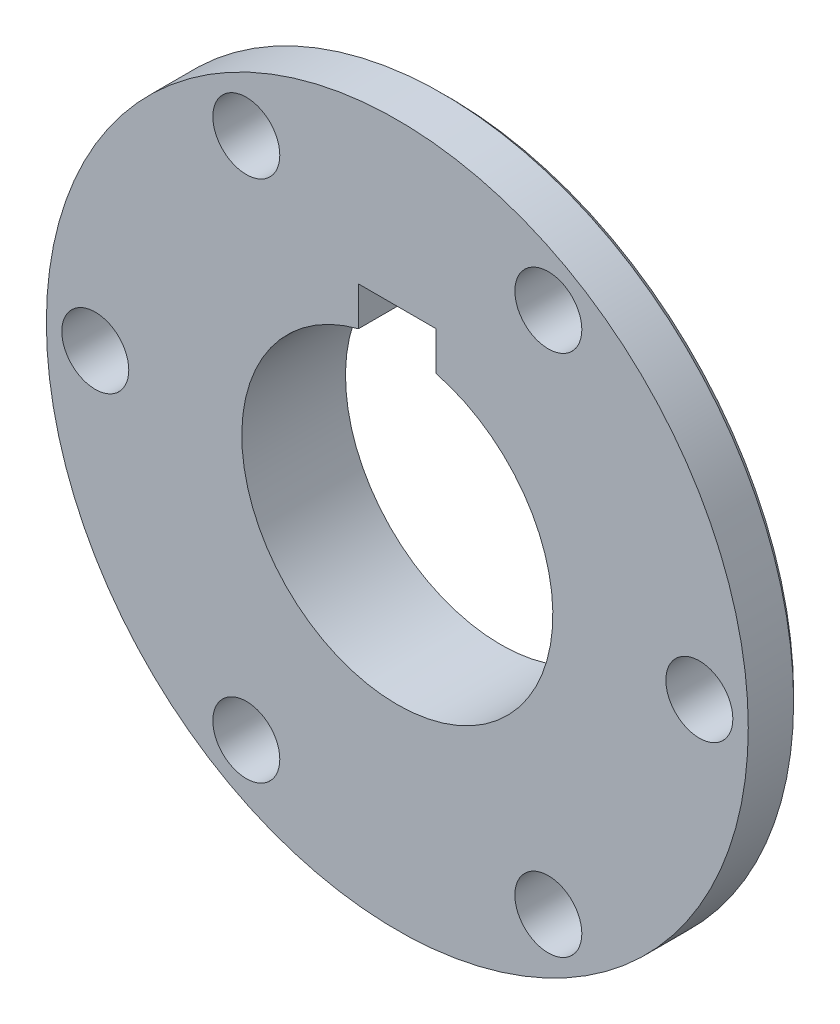
ISO-10303-21;
HEADER;
FILE_DESCRIPTION(('STEP AP214'),'2;1');
FILE_NAME('part.step','',(''),(''),'','','');
FILE_SCHEMA(('AUTOMOTIVE_DESIGN { 1 0 10303 214 1 1 1 1 }'));
ENDSEC;
DATA;
#1=APPLICATION_CONTEXT('core data for automotive mechanical design processes');
#2=APPLICATION_PROTOCOL_DEFINITION('international standard','automotive_design',2000,#1);
#3=PRODUCT_CONTEXT('',#1,'mechanical');
#4=PRODUCT('Part','Part','',(#3));
#5=PRODUCT_RELATED_PRODUCT_CATEGORY('part','',(#4));
#6=PRODUCT_DEFINITION_FORMATION('','',#4);
#7=PRODUCT_DEFINITION_CONTEXT('part definition',#1,'design');
#8=PRODUCT_DEFINITION('design','',#6,#7);
#9=PRODUCT_DEFINITION_SHAPE('','',#8);
#10=(LENGTH_UNIT() NAMED_UNIT(*) SI_UNIT(.MILLI.,.METRE.));
#11=(NAMED_UNIT(*) PLANE_ANGLE_UNIT() SI_UNIT($,.RADIAN.));
#12=(NAMED_UNIT(*) SI_UNIT($,.STERADIAN.) SOLID_ANGLE_UNIT());
#13=UNCERTAINTY_MEASURE_WITH_UNIT(LENGTH_MEASURE(1.E-05),#10,'distance_accuracy_value','');
#14=(GEOMETRIC_REPRESENTATION_CONTEXT(3) GLOBAL_UNCERTAINTY_ASSIGNED_CONTEXT((#13)) GLOBAL_UNIT_ASSIGNED_CONTEXT((#10,
#11,#12)) REPRESENTATION_CONTEXT('',''));
#15=CARTESIAN_POINT('',(0.,0.,0.));
#16=DIRECTION('',(0.,0.,1.));
#17=DIRECTION('',(1.,0.,0.));
#18=AXIS2_PLACEMENT_3D('',#15,#16,#17);
#19=CARTESIAN_POINT('',(0.,0.,0.));
#20=DIRECTION('',(0.,0.,1.));
#21=DIRECTION('',(1.,0.,0.));
#22=AXIS2_PLACEMENT_3D('',#19,#20,#21);
#23=PLANE('',#22);
#24=CARTESIAN_POINT('',(0.,0.,0.));
#25=DIRECTION('',(0.,0.,1.));
#26=DIRECTION('',(1.,0.,0.));
#27=AXIS2_PLACEMENT_3D('',#24,#25,#26);
#28=CIRCLE('',#27,27.0884577277548);
#29=CARTESIAN_POINT('',(27.0884577277548,0.,0.));
#30=VERTEX_POINT('',#29);
#31=EDGE_CURVE('E125',#30,#30,#28,.F.);
#32=ORIENTED_EDGE('',*,*,#31,.T.);
#33=EDGE_LOOP('',(#32));
#34=FACE_BOUND('',#33,.T.);
#35=CARTESIAN_POINT('',(0.,0.,0.));
#36=DIRECTION('',(0.,0.,1.));
#37=DIRECTION('',(-1.,0.,0.));
#38=AXIS2_PLACEMENT_3D('',#35,#36,#37);
#39=CIRCLE('',#38,19.05);
#40=CARTESIAN_POINT('',(-4.7625,18.4450831863128,0.));
#41=VERTEX_POINT('',#40);
#42=CARTESIAN_POINT('',(4.7625,18.4450831863128,0.));
#43=VERTEX_POINT('',#42);
#44=EDGE_CURVE('E59',#41,#43,#39,.T.);
#45=ORIENTED_EDGE('',*,*,#44,.T.);
#46=DIRECTION('',(0.,1.,0.));
#47=VECTOR('',#46,1.);
#48=CARTESIAN_POINT('',(4.7625,23.2075831863128,0.));
#49=LINE('',#48,#47);
#50=CARTESIAN_POINT('',(4.7625,23.2075831863128,0.));
#51=VERTEX_POINT('',#50);
#52=EDGE_CURVE('E92',#43,#51,#49,.T.);
#53=ORIENTED_EDGE('',*,*,#52,.T.);
#54=DIRECTION('',(-1.,0.,0.));
#55=VECTOR('',#54,1.);
#56=CARTESIAN_POINT('',(4.7625,23.2075831863128,0.));
#57=LINE('',#56,#55);
#58=CARTESIAN_POINT('',(-4.7625,23.2075831863128,0.));
#59=VERTEX_POINT('',#58);
#60=EDGE_CURVE('E108',#51,#59,#57,.T.);
#61=ORIENTED_EDGE('',*,*,#60,.T.);
#62=DIRECTION('',(0.,-1.,0.));
#63=VECTOR('',#62,1.);
#64=CARTESIAN_POINT('',(-4.7625,23.2075831863128,0.));
#65=LINE('',#64,#63);
#66=EDGE_CURVE('E86',#59,#41,#65,.T.);
#67=ORIENTED_EDGE('',*,*,#66,.T.);
#68=EDGE_LOOP('',(#45,#53,#61,#67));
#69=FACE_BOUND('',#68,.T.);
#70=ADVANCED_FACE('F36',(#34,#69),#23,.F.);
#71=CARTESIAN_POINT('',(0.,0.,12.7));
#72=DIRECTION('',(0.,0.,1.));
#73=DIRECTION('',(1.,0.,0.));
#74=AXIS2_PLACEMENT_3D('',#71,#72,#73);
#75=PLANE('',#74);
#76=CARTESIAN_POINT('',(18.49755,32.0386964254,12.7));
#77=DIRECTION('',(0.,0.,1.));
#78=DIRECTION('',(1.,0.,0.));
#79=AXIS2_PLACEMENT_3D('',#76,#77,#78);
#80=CIRCLE('',#79,4.10210000000001);
#81=CARTESIAN_POINT('',(22.59965,32.0386964254,12.7));
#82=VERTEX_POINT('',#81);
#83=EDGE_CURVE('E337',#82,#82,#80,.T.);
#84=ORIENTED_EDGE('',*,*,#83,.F.);
#85=EDGE_LOOP('',(#84));
#86=FACE_BOUND('',#85,.T.);
#87=CARTESIAN_POINT('',(-18.49755,32.0386964254,12.7));
#88=DIRECTION('',(0.,0.,1.));
#89=DIRECTION('',(1.,0.,0.));
#90=AXIS2_PLACEMENT_3D('',#87,#88,#89);
#91=CIRCLE('',#90,4.10210000000001);
#92=CARTESIAN_POINT('',(-14.39545,32.0386964254,12.7));
#93=VERTEX_POINT('',#92);
#94=EDGE_CURVE('E334',#93,#93,#91,.T.);
#95=ORIENTED_EDGE('',*,*,#94,.F.);
#96=EDGE_LOOP('',(#95));
#97=FACE_BOUND('',#96,.T.);
#98=CARTESIAN_POINT('',(-36.9951,0.,12.7));
#99=DIRECTION('',(0.,0.,1.));
#100=DIRECTION('',(1.,0.,0.));
#101=AXIS2_PLACEMENT_3D('',#98,#99,#100);
#102=CIRCLE('',#101,4.10210000000001);
#103=CARTESIAN_POINT('',(-32.893,0.,12.7));
#104=VERTEX_POINT('',#103);
#105=EDGE_CURVE('E331',#104,#104,#102,.T.);
#106=ORIENTED_EDGE('',*,*,#105,.F.);
#107=EDGE_LOOP('',(#106));
#108=FACE_BOUND('',#107,.T.);
#109=CARTESIAN_POINT('',(-18.49755,-32.0386964254,12.7));
#110=DIRECTION('',(0.,0.,1.));
#111=DIRECTION('',(1.,0.,0.));
#112=AXIS2_PLACEMENT_3D('',#109,#110,#111);
#113=CIRCLE('',#112,4.10210000000001);
#114=CARTESIAN_POINT('',(-14.39545,-32.0386964254,12.7));
#115=VERTEX_POINT('',#114);
#116=EDGE_CURVE('E326',#115,#115,#113,.T.);
#117=ORIENTED_EDGE('',*,*,#116,.F.);
#118=EDGE_LOOP('',(#117));
#119=FACE_BOUND('',#118,.T.);
#120=CARTESIAN_POINT('',(18.49755,-32.0386964254,12.7));
#121=DIRECTION('',(0.,0.,1.));
#122=DIRECTION('',(1.,0.,0.));
#123=AXIS2_PLACEMENT_3D('',#120,#121,#122);
#124=CIRCLE('',#123,4.10210000000001);
#125=CARTESIAN_POINT('',(22.59965,-32.0386964254,12.7));
#126=VERTEX_POINT('',#125);
#127=EDGE_CURVE('E324',#126,#126,#124,.T.);
#128=ORIENTED_EDGE('',*,*,#127,.F.);
#129=EDGE_LOOP('',(#128));
#130=FACE_BOUND('',#129,.T.);
#131=CARTESIAN_POINT('',(36.9951,0.,12.7));
#132=DIRECTION('',(0.,0.,1.));
#133=DIRECTION('',(1.,0.,0.));
#134=AXIS2_PLACEMENT_3D('',#131,#132,#133);
#135=CIRCLE('',#134,4.10210000000001);
#136=CARTESIAN_POINT('',(41.0972,0.,12.7));
#137=VERTEX_POINT('',#136);
#138=EDGE_CURVE('E106',#137,#137,#135,.T.);
#139=ORIENTED_EDGE('',*,*,#138,.F.);
#140=EDGE_LOOP('',(#139));
#141=FACE_BOUND('',#140,.T.);
#142=CARTESIAN_POINT('',(0.,0.,12.7));
#143=DIRECTION('',(0.,0.,1.));
#144=DIRECTION('',(1.,0.,0.));
#145=AXIS2_PLACEMENT_3D('',#142,#143,#144);
#146=CIRCLE('',#145,42.9895);
#147=CARTESIAN_POINT('',(42.9895,0.,12.7));
#148=VERTEX_POINT('',#147);
#149=EDGE_CURVE('E93',#148,#148,#146,.T.);
#150=ORIENTED_EDGE('',*,*,#149,.T.);
#151=EDGE_LOOP('',(#150));
#152=FACE_BOUND('',#151,.T.);
#153=DIRECTION('',(0.,1.,0.));
#154=VECTOR('',#153,1.);
#155=CARTESIAN_POINT('',(4.7625,23.2075831863128,12.7));
#156=LINE('',#155,#154);
#157=CARTESIAN_POINT('',(4.7625,18.4450831863128,12.7));
#158=VERTEX_POINT('',#157);
#159=CARTESIAN_POINT('',(4.7625,23.2075831863128,12.7));
#160=VERTEX_POINT('',#159);
#161=EDGE_CURVE('E85',#158,#160,#156,.T.);
#162=ORIENTED_EDGE('',*,*,#161,.F.);
#163=CARTESIAN_POINT('',(0.,0.,12.7));
#164=DIRECTION('',(0.,0.,1.));
#165=DIRECTION('',(-1.,0.,0.));
#166=AXIS2_PLACEMENT_3D('',#163,#164,#165);
#167=CIRCLE('',#166,19.05);
#168=CARTESIAN_POINT('',(-4.7625,18.4450831863128,12.7));
#169=VERTEX_POINT('',#168);
#170=EDGE_CURVE('E77',#169,#158,#167,.T.);
#171=ORIENTED_EDGE('',*,*,#170,.F.);
#172=DIRECTION('',(0.,-1.,0.));
#173=VECTOR('',#172,1.);
#174=CARTESIAN_POINT('',(-4.7625,23.2075831863128,12.7));
#175=LINE('',#174,#173);
#176=CARTESIAN_POINT('',(-4.7625,23.2075831863128,12.7));
#177=VERTEX_POINT('',#176);
#178=EDGE_CURVE('E100',#177,#169,#175,.T.);
#179=ORIENTED_EDGE('',*,*,#178,.F.);
#180=DIRECTION('',(-1.,0.,0.));
#181=VECTOR('',#180,1.);
#182=CARTESIAN_POINT('',(4.7625,23.2075831863128,12.7));
#183=LINE('',#182,#181);
#184=EDGE_CURVE('E98',#160,#177,#183,.T.);
#185=ORIENTED_EDGE('',*,*,#184,.F.);
#186=EDGE_LOOP('',(#162,#171,#179,#185));
#187=FACE_BOUND('',#186,.T.);
#188=ADVANCED_FACE('F97',(#86,#97,#108,#119,#130,#141,#152,#187),#75,.T.);
#189=CARTESIAN_POINT('',(0.,0.,12.7));
#190=DIRECTION('',(0.,0.,-1.));
#191=DIRECTION('',(-1.,0.,0.));
#192=AXIS2_PLACEMENT_3D('',#189,#190,#191);
#193=CYLINDRICAL_SURFACE('',#192,42.9895);
#194=CARTESIAN_POINT('',(0.,0.,7.14375));
#195=DIRECTION('',(0.,0.,1.));
#196=DIRECTION('',(1.,0.,0.));
#197=AXIS2_PLACEMENT_3D('',#194,#195,#196);
#198=CIRCLE('',#197,42.9895);
#199=CARTESIAN_POINT('',(42.9895,0.,7.14375));
#200=VERTEX_POINT('',#199);
#201=EDGE_CURVE('E128',#200,#200,#198,.T.);
#202=ORIENTED_EDGE('',*,*,#201,.T.);
#203=EDGE_LOOP('',(#202));
#204=FACE_BOUND('',#203,.T.);
#205=ORIENTED_EDGE('',*,*,#149,.F.);
#206=EDGE_LOOP('',(#205));
#207=FACE_BOUND('',#206,.T.);
#208=ADVANCED_FACE('F154',(#204,#207),#193,.T.);
#209=CARTESIAN_POINT('',(0.,0.,12.7));
#210=DIRECTION('',(0.,0.,-1.));
#211=DIRECTION('',(-1.,0.,0.));
#212=AXIS2_PLACEMENT_3D('',#209,#210,#211);
#213=CYLINDRICAL_SURFACE('',#212,19.05);
#214=ORIENTED_EDGE('',*,*,#44,.F.);
#215=DIRECTION('',(0.,0.,-1.));
#216=VECTOR('',#215,1.);
#217=CARTESIAN_POINT('',(-4.7625,18.4450831863128,12.7));
#218=LINE('',#217,#216);
#219=EDGE_CURVE('E81',#169,#41,#218,.T.);
#220=ORIENTED_EDGE('',*,*,#219,.F.);
#221=ORIENTED_EDGE('',*,*,#170,.T.);
#222=DIRECTION('',(0.,0.,-1.));
#223=VECTOR('',#222,1.);
#224=CARTESIAN_POINT('',(4.7625,18.4450831863128,12.7));
#225=LINE('',#224,#223);
#226=EDGE_CURVE('E80',#158,#43,#225,.T.);
#227=ORIENTED_EDGE('',*,*,#226,.T.);
#228=EDGE_LOOP('',(#214,#220,#221,#227));
#229=FACE_BOUND('',#228,.T.);
#230=ADVANCED_FACE('F79',(#229),#213,.F.);
#231=CARTESIAN_POINT('',(4.7625,23.2075831863128,12.7));
#232=DIRECTION('',(-1.,0.,0.));
#233=DIRECTION('',(0.,-1.,0.));
#234=AXIS2_PLACEMENT_3D('',#231,#232,#233);
#235=PLANE('',#234);
#236=ORIENTED_EDGE('',*,*,#52,.F.);
#237=ORIENTED_EDGE('',*,*,#226,.F.);
#238=ORIENTED_EDGE('',*,*,#161,.T.);
#239=DIRECTION('',(0.,0.,-1.));
#240=VECTOR('',#239,1.);
#241=CARTESIAN_POINT('',(4.7625,23.2075831863128,12.7));
#242=LINE('',#241,#240);
#243=EDGE_CURVE('E94',#160,#51,#242,.T.);
#244=ORIENTED_EDGE('',*,*,#243,.T.);
#245=EDGE_LOOP('',(#236,#237,#238,#244));
#246=FACE_BOUND('',#245,.T.);
#247=ADVANCED_FACE('F89',(#246),#235,.T.);
#248=CARTESIAN_POINT('',(4.7625,23.2075831863128,12.7));
#249=DIRECTION('',(0.,-1.,0.));
#250=DIRECTION('',(0.,0.,-1.));
#251=AXIS2_PLACEMENT_3D('',#248,#249,#250);
#252=PLANE('',#251);
#253=ORIENTED_EDGE('',*,*,#60,.F.);
#254=ORIENTED_EDGE('',*,*,#243,.F.);
#255=ORIENTED_EDGE('',*,*,#184,.T.);
#256=DIRECTION('',(0.,0.,-1.));
#257=VECTOR('',#256,1.);
#258=CARTESIAN_POINT('',(-4.7625,23.2075831863128,12.7));
#259=LINE('',#258,#257);
#260=EDGE_CURVE('E51',#177,#59,#259,.T.);
#261=ORIENTED_EDGE('',*,*,#260,.T.);
#262=EDGE_LOOP('',(#253,#254,#255,#261));
#263=FACE_BOUND('',#262,.T.);
#264=ADVANCED_FACE('F207',(#263),#252,.T.);
#265=CARTESIAN_POINT('',(-4.7625,23.2075831863128,12.7));
#266=DIRECTION('',(1.,0.,0.));
#267=DIRECTION('',(0.,0.,-1.));
#268=AXIS2_PLACEMENT_3D('',#265,#266,#267);
#269=PLANE('',#268);
#270=ORIENTED_EDGE('',*,*,#66,.F.);
#271=ORIENTED_EDGE('',*,*,#260,.F.);
#272=ORIENTED_EDGE('',*,*,#178,.T.);
#273=ORIENTED_EDGE('',*,*,#219,.T.);
#274=EDGE_LOOP('',(#270,#271,#272,#273));
#275=FACE_BOUND('',#274,.T.);
#276=ADVANCED_FACE('F203',(#275),#269,.T.);
#277=CARTESIAN_POINT('',(36.9951,0.,12.7));
#278=DIRECTION('',(0.,0.,-1.));
#279=DIRECTION('',(-1.,0.,0.));
#280=AXIS2_PLACEMENT_3D('',#277,#278,#279);
#281=CYLINDRICAL_SURFACE('',#280,4.10210000000001);
#282=CARTESIAN_POINT('',(36.9951,0.,6.35));
#283=DIRECTION('',(0.,0.,1.));
#284=DIRECTION('',(1.,0.,0.));
#285=AXIS2_PLACEMENT_3D('',#282,#283,#284);
#286=CIRCLE('',#285,4.10210000000001);
#287=CARTESIAN_POINT('',(41.0972,0.,6.35));
#288=VERTEX_POINT('',#287);
#289=EDGE_CURVE('E320',#288,#288,#286,.T.);
#290=ORIENTED_EDGE('',*,*,#289,.F.);
#291=EDGE_LOOP('',(#290));
#292=FACE_BOUND('',#291,.T.);
#293=ORIENTED_EDGE('',*,*,#138,.T.);
#294=EDGE_LOOP('',(#293));
#295=FACE_BOUND('',#294,.T.);
#296=ADVANCED_FACE('F199',(#292,#295),#281,.F.);
#297=CARTESIAN_POINT('',(18.49755,-32.0386964254,12.7));
#298=DIRECTION('',(0.,0.,-1.));
#299=DIRECTION('',(-1.,0.,0.));
#300=AXIS2_PLACEMENT_3D('',#297,#298,#299);
#301=CYLINDRICAL_SURFACE('',#300,4.10210000000001);
#302=CARTESIAN_POINT('',(18.49755,-32.0386964254,6.35));
#303=DIRECTION('',(0.,0.,1.));
#304=DIRECTION('',(1.,0.,0.));
#305=AXIS2_PLACEMENT_3D('',#302,#303,#304);
#306=CIRCLE('',#305,4.10210000000001);
#307=CARTESIAN_POINT('',(22.59965,-32.0386964254,6.35));
#308=VERTEX_POINT('',#307);
#309=EDGE_CURVE('E341',#308,#308,#306,.T.);
#310=ORIENTED_EDGE('',*,*,#309,.F.);
#311=EDGE_LOOP('',(#310));
#312=FACE_BOUND('',#311,.T.);
#313=ORIENTED_EDGE('',*,*,#127,.T.);
#314=EDGE_LOOP('',(#313));
#315=FACE_BOUND('',#314,.T.);
#316=ADVANCED_FACE('F195',(#312,#315),#301,.F.);
#317=CARTESIAN_POINT('',(-18.49755,-32.0386964254,12.7));
#318=DIRECTION('',(0.,0.,-1.));
#319=DIRECTION('',(-1.,0.,0.));
#320=AXIS2_PLACEMENT_3D('',#317,#318,#319);
#321=CYLINDRICAL_SURFACE('',#320,4.10210000000001);
#322=CARTESIAN_POINT('',(-18.49755,-32.0386964254,6.35));
#323=DIRECTION('',(0.,0.,1.));
#324=DIRECTION('',(1.,0.,0.));
#325=AXIS2_PLACEMENT_3D('',#322,#323,#324);
#326=CIRCLE('',#325,4.10210000000001);
#327=CARTESIAN_POINT('',(-14.39545,-32.0386964254,6.35));
#328=VERTEX_POINT('',#327);
#329=EDGE_CURVE('E344',#328,#328,#326,.T.);
#330=ORIENTED_EDGE('',*,*,#329,.F.);
#331=EDGE_LOOP('',(#330));
#332=FACE_BOUND('',#331,.T.);
#333=ORIENTED_EDGE('',*,*,#116,.T.);
#334=EDGE_LOOP('',(#333));
#335=FACE_BOUND('',#334,.T.);
#336=ADVANCED_FACE('F191',(#332,#335),#321,.F.);
#337=CARTESIAN_POINT('',(-36.9951,0.,12.7));
#338=DIRECTION('',(0.,0.,-1.));
#339=DIRECTION('',(-1.,0.,0.));
#340=AXIS2_PLACEMENT_3D('',#337,#338,#339);
#341=CYLINDRICAL_SURFACE('',#340,4.10210000000001);
#342=CARTESIAN_POINT('',(-36.9951,0.,6.35));
#343=DIRECTION('',(0.,0.,1.));
#344=DIRECTION('',(1.,0.,0.));
#345=AXIS2_PLACEMENT_3D('',#342,#343,#344);
#346=CIRCLE('',#345,4.10210000000001);
#347=CARTESIAN_POINT('',(-32.893,0.,6.35));
#348=VERTEX_POINT('',#347);
#349=EDGE_CURVE('E347',#348,#348,#346,.T.);
#350=ORIENTED_EDGE('',*,*,#349,.F.);
#351=EDGE_LOOP('',(#350));
#352=FACE_BOUND('',#351,.T.);
#353=ORIENTED_EDGE('',*,*,#105,.T.);
#354=EDGE_LOOP('',(#353));
#355=FACE_BOUND('',#354,.T.);
#356=ADVANCED_FACE('F187',(#352,#355),#341,.F.);
#357=CARTESIAN_POINT('',(-18.49755,32.0386964254,12.7));
#358=DIRECTION('',(0.,0.,-1.));
#359=DIRECTION('',(-1.,0.,0.));
#360=AXIS2_PLACEMENT_3D('',#357,#358,#359);
#361=CYLINDRICAL_SURFACE('',#360,4.10210000000001);
#362=CARTESIAN_POINT('',(-18.49755,32.0386964254,6.35));
#363=DIRECTION('',(0.,0.,1.));
#364=DIRECTION('',(1.,0.,0.));
#365=AXIS2_PLACEMENT_3D('',#362,#363,#364);
#366=CIRCLE('',#365,4.10210000000001);
#367=CARTESIAN_POINT('',(-14.39545,32.0386964254,6.35));
#368=VERTEX_POINT('',#367);
#369=EDGE_CURVE('E122',#368,#368,#366,.T.);
#370=ORIENTED_EDGE('',*,*,#369,.F.);
#371=EDGE_LOOP('',(#370));
#372=FACE_BOUND('',#371,.T.);
#373=ORIENTED_EDGE('',*,*,#94,.T.);
#374=EDGE_LOOP('',(#373));
#375=FACE_BOUND('',#374,.T.);
#376=ADVANCED_FACE('F183',(#372,#375),#361,.F.);
#377=CARTESIAN_POINT('',(18.49755,32.0386964254,12.7));
#378=DIRECTION('',(0.,0.,-1.));
#379=DIRECTION('',(-1.,0.,0.));
#380=AXIS2_PLACEMENT_3D('',#377,#378,#379);
#381=CYLINDRICAL_SURFACE('',#380,4.10210000000001);
#382=CARTESIAN_POINT('',(18.49755,32.0386964254,6.35));
#383=DIRECTION('',(0.,0.,1.));
#384=DIRECTION('',(1.,0.,0.));
#385=AXIS2_PLACEMENT_3D('',#382,#383,#384);
#386=CIRCLE('',#385,4.10210000000001);
#387=CARTESIAN_POINT('',(22.59965,32.0386964254,6.35));
#388=VERTEX_POINT('',#387);
#389=EDGE_CURVE('E119',#388,#388,#386,.T.);
#390=ORIENTED_EDGE('',*,*,#389,.F.);
#391=EDGE_LOOP('',(#390));
#392=FACE_BOUND('',#391,.T.);
#393=ORIENTED_EDGE('',*,*,#83,.T.);
#394=EDGE_LOOP('',(#393));
#395=FACE_BOUND('',#394,.T.);
#396=ADVANCED_FACE('F178',(#392,#395),#381,.F.);
#397=CARTESIAN_POINT('',(0.,0.,6.35));
#398=DIRECTION('',(0.,0.,1.));
#399=DIRECTION('',(1.,0.,0.));
#400=AXIS2_PLACEMENT_3D('',#397,#398,#399);
#401=PLANE('',#400);
#402=CARTESIAN_POINT('',(0.,0.,6.35));
#403=DIRECTION('',(0.,0.,1.));
#404=DIRECTION('',(1.,0.,0.));
#405=AXIS2_PLACEMENT_3D('',#402,#403,#404);
#406=CIRCLE('',#405,28.6759577277548);
#407=CARTESIAN_POINT('',(28.6759577277548,0.,6.35));
#408=VERTEX_POINT('',#407);
#409=EDGE_CURVE('E44',#408,#408,#406,.T.);
#410=ORIENTED_EDGE('',*,*,#409,.T.);
#411=EDGE_LOOP('',(#410));
#412=FACE_BOUND('',#411,.T.);
#413=CARTESIAN_POINT('',(0.,0.,6.35));
#414=DIRECTION('',(0.,0.,1.));
#415=DIRECTION('',(1.,0.,0.));
#416=AXIS2_PLACEMENT_3D('',#413,#414,#415);
#417=CIRCLE('',#416,42.19575);
#418=CARTESIAN_POINT('',(42.19575,0.,6.35));
#419=VERTEX_POINT('',#418);
#420=EDGE_CURVE('E131',#419,#419,#417,.F.);
#421=ORIENTED_EDGE('',*,*,#420,.T.);
#422=EDGE_LOOP('',(#421));
#423=FACE_BOUND('',#422,.T.);
#424=ORIENTED_EDGE('',*,*,#389,.T.);
#425=EDGE_LOOP('',(#424));
#426=FACE_BOUND('',#425,.T.);
#427=ORIENTED_EDGE('',*,*,#369,.T.);
#428=EDGE_LOOP('',(#427));
#429=FACE_BOUND('',#428,.T.);
#430=ORIENTED_EDGE('',*,*,#349,.T.);
#431=EDGE_LOOP('',(#430));
#432=FACE_BOUND('',#431,.T.);
#433=ORIENTED_EDGE('',*,*,#329,.T.);
#434=EDGE_LOOP('',(#433));
#435=FACE_BOUND('',#434,.T.);
#436=ORIENTED_EDGE('',*,*,#309,.T.);
#437=EDGE_LOOP('',(#436));
#438=FACE_BOUND('',#437,.T.);
#439=ORIENTED_EDGE('',*,*,#289,.T.);
#440=EDGE_LOOP('',(#439));
#441=FACE_BOUND('',#440,.T.);
#442=ADVANCED_FACE('F136',(#412,#423,#426,#429,#432,#435,#438,#441),#401,.F.);
#443=CARTESIAN_POINT('',(0.,0.,6.35));
#444=DIRECTION('',(0.,0.,-1.));
#445=DIRECTION('',(-1.,0.,0.));
#446=AXIS2_PLACEMENT_3D('',#443,#444,#445);
#447=CYLINDRICAL_SURFACE('',#446,27.8822077277548);
#448=CARTESIAN_POINT('',(0.,0.,5.55625));
#449=DIRECTION('',(0.,0.,1.));
#450=DIRECTION('',(1.,0.,0.));
#451=AXIS2_PLACEMENT_3D('',#448,#449,#450);
#452=CIRCLE('',#451,27.8822077277548);
#453=CARTESIAN_POINT('',(27.8822077277548,0.,5.55625));
#454=VERTEX_POINT('',#453);
#455=EDGE_CURVE('E12',#454,#454,#452,.F.);
#456=ORIENTED_EDGE('',*,*,#455,.T.);
#457=EDGE_LOOP('',(#456));
#458=FACE_BOUND('',#457,.T.);
#459=CARTESIAN_POINT('',(0.,0.,0.793749999999989));
#460=DIRECTION('',(0.,0.,1.));
#461=DIRECTION('',(1.,0.,0.));
#462=AXIS2_PLACEMENT_3D('',#459,#460,#461);
#463=CIRCLE('',#462,27.8822077277548);
#464=CARTESIAN_POINT('',(27.8822077277548,0.,0.793749999999989));
#465=VERTEX_POINT('',#464);
#466=EDGE_CURVE('E118',#465,#465,#463,.T.);
#467=ORIENTED_EDGE('',*,*,#466,.T.);
#468=EDGE_LOOP('',(#467));
#469=FACE_BOUND('',#468,.T.);
#470=ADVANCED_FACE('F164',(#458,#469),#447,.T.);
#471=CARTESIAN_POINT('',(0.,0.,0.793749999999989));
#472=DIRECTION('',(0.,0.,1.));
#473=DIRECTION('',(1.,0.,0.));
#474=AXIS2_PLACEMENT_3D('',#471,#472,#473);
#475=CONICAL_SURFACE('',#474,27.8822077277548,0.785398163397455);
#476=ORIENTED_EDGE('',*,*,#31,.F.);
#477=EDGE_LOOP('',(#476));
#478=FACE_BOUND('',#477,.T.);
#479=ORIENTED_EDGE('',*,*,#466,.F.);
#480=EDGE_LOOP('',(#479));
#481=FACE_BOUND('',#480,.T.);
#482=ADVANCED_FACE('F145',(#478,#481),#475,.T.);
#483=CARTESIAN_POINT('',(0.,0.,7.14375));
#484=DIRECTION('',(0.,0.,1.));
#485=DIRECTION('',(1.,0.,0.));
#486=AXIS2_PLACEMENT_3D('',#483,#484,#485);
#487=CONICAL_SURFACE('',#486,42.9895,0.785398163397444);
#488=ORIENTED_EDGE('',*,*,#420,.F.);
#489=EDGE_LOOP('',(#488));
#490=FACE_BOUND('',#489,.T.);
#491=ORIENTED_EDGE('',*,*,#201,.F.);
#492=EDGE_LOOP('',(#491));
#493=FACE_BOUND('',#492,.T.);
#494=ADVANCED_FACE('F140',(#490,#493),#487,.T.);
#495=CARTESIAN_POINT('',(0.,0.,6.35));
#496=DIRECTION('',(0.,0.,1.));
#497=DIRECTION('',(1.,0.,0.));
#498=AXIS2_PLACEMENT_3D('',#495,#496,#497);
#499=CONICAL_SURFACE('',#498,28.6759577277548,0.785398163397457);
#500=ORIENTED_EDGE('',*,*,#455,.F.);
#501=EDGE_LOOP('',(#500));
#502=FACE_BOUND('',#501,.T.);
#503=ORIENTED_EDGE('',*,*,#409,.F.);
#504=EDGE_LOOP('',(#503));
#505=FACE_BOUND('',#504,.T.);
#506=ADVANCED_FACE('F38',(#502,#505),#499,.T.);
#507=CLOSED_SHELL('',(#70,#188,#208,#230,#247,#264,#276,#296,#316,#336,#356,#376,#396,#442,#470,
#482,#494,#506));
#508=MANIFOLD_SOLID_BREP('B2',#507);
#509=ADVANCED_BREP_SHAPE_REPRESENTATION('',(#18,#508),#14);
#510=SHAPE_DEFINITION_REPRESENTATION(#9,#509);
ENDSEC;
END-ISO-10303-21;
